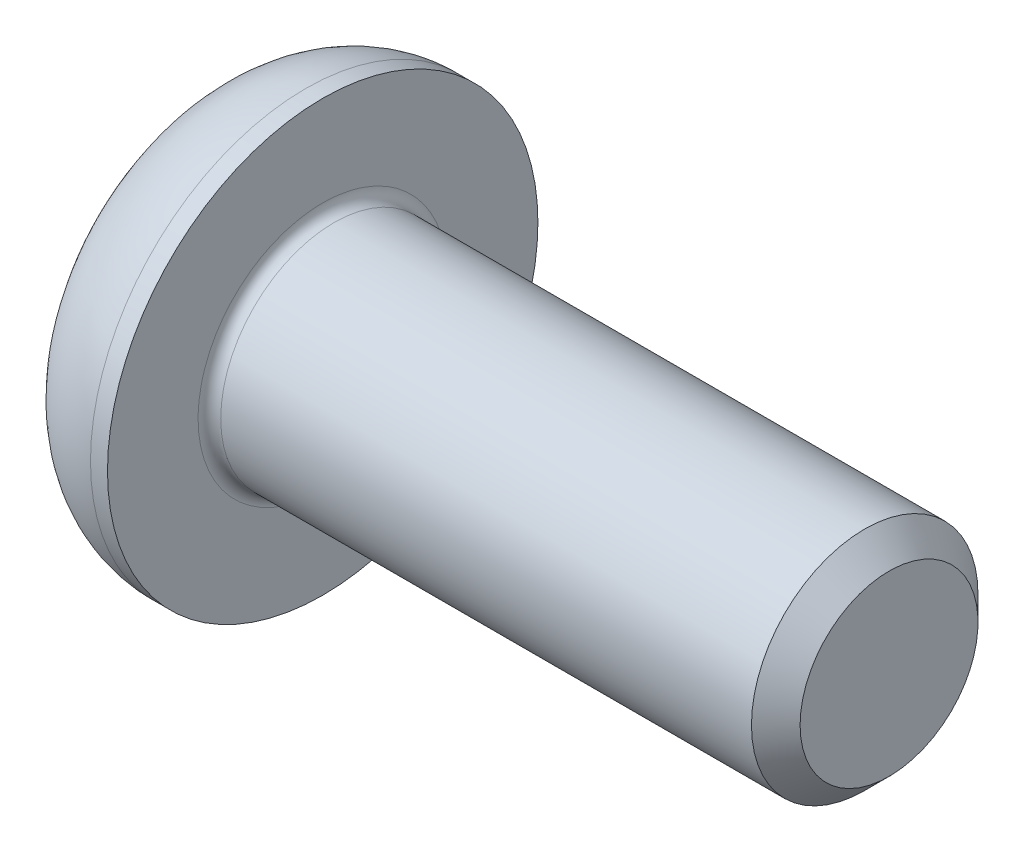
ISO-10303-21;
HEADER;
FILE_DESCRIPTION(('STEP AP214'),'2;1');
FILE_NAME('part.step','',(''),(''),'','','');
FILE_SCHEMA(('AUTOMOTIVE_DESIGN { 1 0 10303 214 1 1 1 1 }'));
ENDSEC;
DATA;
#1=APPLICATION_CONTEXT('core data for automotive mechanical design processes');
#2=APPLICATION_PROTOCOL_DEFINITION('international standard','automotive_design',2000,#1);
#3=PRODUCT_CONTEXT('',#1,'mechanical');
#4=PRODUCT('Part','Part','',(#3));
#5=PRODUCT_RELATED_PRODUCT_CATEGORY('part','',(#4));
#6=PRODUCT_DEFINITION_FORMATION('','',#4);
#7=PRODUCT_DEFINITION_CONTEXT('part definition',#1,'design');
#8=PRODUCT_DEFINITION('design','',#6,#7);
#9=PRODUCT_DEFINITION_SHAPE('','',#8);
#10=(LENGTH_UNIT() NAMED_UNIT(*) SI_UNIT(.MILLI.,.METRE.));
#11=(NAMED_UNIT(*) PLANE_ANGLE_UNIT() SI_UNIT($,.RADIAN.));
#12=(NAMED_UNIT(*) SI_UNIT($,.STERADIAN.) SOLID_ANGLE_UNIT());
#13=UNCERTAINTY_MEASURE_WITH_UNIT(LENGTH_MEASURE(1.E-05),#10,'distance_accuracy_value','');
#14=(GEOMETRIC_REPRESENTATION_CONTEXT(3) GLOBAL_UNCERTAINTY_ASSIGNED_CONTEXT((#13)) GLOBAL_UNIT_ASSIGNED_CONTEXT((#10,
#11,#12)) REPRESENTATION_CONTEXT('',''));
#15=CARTESIAN_POINT('',(0.,0.,0.));
#16=DIRECTION('',(0.,0.,1.));
#17=DIRECTION('',(1.,0.,0.));
#18=AXIS2_PLACEMENT_3D('',#15,#16,#17);
#19=CARTESIAN_POINT('',(-0.904999999875145,0.,0.));
#20=DIRECTION('',(-1.,0.,0.));
#21=DIRECTION('',(0.,0.,1.));
#22=AXIS2_PLACEMENT_3D('',#19,#20,#21);
#23=CONICAL_SURFACE('',#22,1.45203592671805,1.04719755115765);
#24=CARTESIAN_POINT('',(-0.0666666666973015,-5.6843418860808E-11,0.));
#25=VERTEX_POINT('',#24);
#26=VERTEX_LOOP('',#25);
#27=FACE_BOUND('',#26,.T.);
#28=CARTESIAN_POINT('',(-0.899999999895465,1.24999999991282,-0.721687836705776));
#29=CARTESIAN_POINT('',(-0.881684715662103,1.19507007013616,-0.753401646340966));
#30=CARTESIAN_POINT('',(-0.865027923174486,1.1396659860227,-0.785389209173815));
#31=CARTESIAN_POINT('',(-0.835953992139613,1.02789853317084,-0.84991817813204));
#32=CARTESIAN_POINT('',(-0.823547137724434,0.971533179187624,-0.882460730439183));
#33=CARTESIAN_POINT('',(-0.804234974358824,0.859500978788186,-0.947142551506237));
#34=CARTESIAN_POINT('',(-0.797201117271249,0.803851365133497,-0.979271870927009));
#35=CARTESIAN_POINT('',(-0.78880573011305,0.692290424620332,-1.04368160996113));
#36=CARTESIAN_POINT('',(-0.787437246268047,0.636379502977309,-1.07596179562322));
#37=CARTESIAN_POINT('',(-0.790291431384831,0.531915943877927,-1.13627385959031));
#38=CARTESIAN_POINT('',(-0.793813303298533,0.483347630813507,-1.16431478821198));
#39=CARTESIAN_POINT('',(-0.804973312984706,0.386527411401505,-1.22021396795239));
#40=CARTESIAN_POINT('',(-0.812615259263485,0.338275839679263,-1.24807202587511));
#41=CARTESIAN_POINT('',(-0.831718645861244,0.241256161485361,-1.30408636319712));
#42=CARTESIAN_POINT('',(-0.843261026405586,0.192500327968863,-1.33223555680244));
#43=CARTESIAN_POINT('',(-0.869457350530444,0.0957156438709913,-1.38811422021978));
#44=CARTESIAN_POINT('',(-0.884105142968317,0.0476855543224275,-1.41584440534985));
#45=CARTESIAN_POINT('',(-0.899999999989879,1.63995568404391E-10,-1.44337567287971));
#46=B_SPLINE_CURVE_WITH_KNOTS('',3,(#28,#29,#30,#31,#32,#33,#34,#35,#36,#37,#38,#39,#40,#41,#42,
#43,#44,#45),.UNSPECIFIED.,.F.,.F.,(4,2,2,2,2,2,2,2,4),(0.,0.198135007186097,0.396746135570628,
0.59044225374554,0.783900555431306,0.952317363947969,1.12089012085788,1.2932010137193,
1.4651737330377),.UNSPECIFIED.);
#47=CARTESIAN_POINT('',(-0.899999999950276,1.24999999980888,-0.721687836492175));
#48=VERTEX_POINT('',#47);
#49=CARTESIAN_POINT('',(-0.899999999982609,1.96257349450005E-12,-1.44337567286712));
#50=VERTEX_POINT('',#49);
#51=EDGE_CURVE('E103',#48,#50,#46,.T.);
#52=ORIENTED_EDGE('',*,*,#51,.T.);
#53=CARTESIAN_POINT('',(-0.899999999893595,-2.31072216434728E-10,-1.44337567300549));
#54=CARTESIAN_POINT('',(-0.881684715660365,-0.0549299299140426,-1.41166186320821));
#55=CARTESIAN_POINT('',(-0.86502792317278,-0.110334013989012,-1.3796743003089));
#56=CARTESIAN_POINT('',(-0.835953992137871,-0.222101466812513,-1.31514533130202));
#57=CARTESIAN_POINT('',(-0.823547137722625,-0.278466820805983,-1.28260277901289));
#58=CARTESIAN_POINT('',(-0.804234974356904,-0.390499021212521,-1.21792095795876));
#59=CARTESIAN_POINT('',(-0.797201117269277,-0.446148634864375,-1.18579163853346));
#60=CARTESIAN_POINT('',(-0.788805730110948,-0.557709575375265,-1.12138189949618));
#61=CARTESIAN_POINT('',(-0.787437246265866,-0.613620497018845,-1.08910171383544));
#62=CARTESIAN_POINT('',(-0.790291431382727,-0.718084056126904,-1.02878964986439));
#63=CARTESIAN_POINT('',(-0.793813303297357,-0.766652369199541,-1.00074872123762));
#64=CARTESIAN_POINT('',(-0.804973312986761,-0.863472588628037,-0.944849541487422));
#65=CARTESIAN_POINT('',(-0.812615259267848,-0.911724160358555,-0.916991483560018));
#66=CARTESIAN_POINT('',(-0.831718645871401,-1.00874383856915,-0.860977146228447));
#67=CARTESIAN_POINT('',(-0.843261026419272,-1.05749967209406,-0.832827952618252));
#68=CARTESIAN_POINT('',(-0.869457350551973,-1.15428435620845,-0.776949289191332));
#69=CARTESIAN_POINT('',(-0.884105142994157,-1.20231444576512,-0.749219104056564));
#70=CARTESIAN_POINT('',(-0.90000000002026,-1.24999999993156,-0.721687836522116));
#71=B_SPLINE_CURVE_WITH_KNOTS('',3,(#53,#54,#55,#56,#57,#58,#59,#60,#61,#62,#63,#64,#65,#66,#67,
#68,#69,#70),.UNSPECIFIED.,.F.,.F.,(4,2,2,2,2,2,2,2,4),(0.,0.198135007185751,0.396746135569964,
0.590442253744319,0.783900555429511,0.952317363975204,1.12089012091425,1.29320101380634,
1.46517373315517),.UNSPECIFIED.);
#72=CARTESIAN_POINT('',(-0.899999999987108,-1.24999999995633,-0.721687836364369));
#73=VERTEX_POINT('',#72);
#74=EDGE_CURVE('E134',#50,#73,#71,.T.);
#75=ORIENTED_EDGE('',*,*,#74,.T.);
#76=CARTESIAN_POINT('',(-0.899999999842174,-1.25000000019539,-0.721687836229797));
#77=CARTESIAN_POINT('',(-0.882896111075563,-1.24999999481034,-0.662444421267075));
#78=CARTESIAN_POINT('',(-0.867237014060793,-1.24999999738598,-0.602732338419685));
#79=CARTESIAN_POINT('',(-0.839561502195528,-1.25000000261982,-0.482338189350465));
#80=CARTESIAN_POINT('',(-0.827553237744171,-1.25000000527818,-0.421654266620353));
#81=CARTESIAN_POINT('',(-0.80824250364639,-1.24999999484458,-0.300967350520173));
#82=CARTESIAN_POINT('',(-0.800837076879798,-1.24999998211752,-0.240981348930731));
#83=CARTESIAN_POINT('',(-0.790895700381869,-1.25000001786304,-0.12066326676355));
#84=CARTESIAN_POINT('',(-0.788354464927657,-1.25000006626909,-0.0603316333839473));
#85=CARTESIAN_POINT('',(-0.788354464927002,-1.25000006626979,0.0603316333939961));
#86=CARTESIAN_POINT('',(-0.790895700382119,-1.25000001786444,0.120663266792337));
#87=CARTESIAN_POINT('',(-0.800837076887306,-1.24999998211612,0.240981348995787));
#88=CARTESIAN_POINT('',(-0.808242503660248,-1.24999999483968,0.30096735060276));
#89=CARTESIAN_POINT('',(-0.827553237762847,-1.25000000528321,0.421654266741162));
#90=CARTESIAN_POINT('',(-0.839561502212521,-1.25000000263868,0.48233818949201));
#91=CARTESIAN_POINT('',(-0.867237014115977,-1.24999999736716,0.602732338592252));
#92=CARTESIAN_POINT('',(-0.882896111170561,-1.24999999474013,0.662444421449945));
#93=CARTESIAN_POINT('',(-0.900000000022398,-1.25,0.72168783641098));
#94=B_SPLINE_CURVE_WITH_KNOTS('',3,(#76,#77,#78,#79,#80,#81,#82,#83,#84,#85,#86,#87,#88,#89,#90,
#91,#92,#93),.UNSPECIFIED.,.F.,.F.,(4,2,2,2,2,2,2,2,4),(0.,0.185045871632975,0.3705018706702,
0.551644291266182,0.732589759614195,0.913535228017753,1.09467764866905,1.28013364776468,
1.46517951945754),.UNSPECIFIED.);
#95=CARTESIAN_POINT('',(-0.899999999988181,-1.24999999987475,0.721687836509393));
#96=VERTEX_POINT('',#95);
#97=EDGE_CURVE('E274',#73,#96,#94,.T.);
#98=ORIENTED_EDGE('',*,*,#97,.T.);
#99=CARTESIAN_POINT('',(-0.899999999842517,-1.24999999987697,0.72168783678411));
#100=CARTESIAN_POINT('',(-0.881684715631303,-1.19507007008352,0.753401646392062));
#101=CARTESIAN_POINT('',(-0.865027923154306,-1.13966598596531,0.785389209212495));
#102=CARTESIAN_POINT('',(-0.835953992130203,-1.02789853311445,0.849918178159034));
#103=CARTESIAN_POINT('',(-0.823547137715168,-0.971533179136998,0.88246073046694));
#104=CARTESIAN_POINT('',(-0.804234974352029,-0.859500978745731,0.947142551532184));
#105=CARTESIAN_POINT('',(-0.797201117266771,-0.803851365093511,0.979271870950477));
#106=CARTESIAN_POINT('',(-0.78880573011195,-0.692290424586258,1.04368160998042));
#107=CARTESIAN_POINT('',(-0.787437246267998,-0.636379502946676,1.07596179564081));
#108=CARTESIAN_POINT('',(-0.79029143138629,-0.531915943852794,1.1362738596049));
#109=CARTESIAN_POINT('',(-0.793813303300584,-0.483347630790453,1.16431478822531));
#110=CARTESIAN_POINT('',(-0.804973312987493,-0.386527411382594,1.22021396796329));
#111=CARTESIAN_POINT('',(-0.812615259266423,-0.338275839662417,1.24807202588483));
#112=CARTESIAN_POINT('',(-0.831718645864065,-0.241256161473001,1.30408636320426));
#113=CARTESIAN_POINT('',(-0.843261026408104,-0.192500327958919,1.33223555680818));
#114=CARTESIAN_POINT('',(-0.869457350531995,-0.0957156438659012,1.38811422022272));
#115=CARTESIAN_POINT('',(-0.8841051429692,-0.0476855543197738,1.41584440535138));
#116=CARTESIAN_POINT('',(-0.899999999989963,-1.63745370551762E-10,1.44337567287986));
#117=B_SPLINE_CURVE_WITH_KNOTS('',3,(#99,#100,#101,#102,#103,#104,#105,#106,#107,#108,#109,#110,
#111,#112,#113,#114,#115,#116),.UNSPECIFIED.,.F.,.F.,(4,2,2,2,2,2,2,2,4),(0.,0.198135007172041,
0.396746135543351,0.590442253707212,0.783900555381576,0.952317363891064,1.120890120794,
1.29320101364705,1.4651737329568),.UNSPECIFIED.);
#118=CARTESIAN_POINT('',(-0.899999999982609,-1.69922557176371E-12,1.44337567286712));
#119=VERTEX_POINT('',#118);
#120=EDGE_CURVE('E269',#96,#119,#117,.T.);
#121=ORIENTED_EDGE('',*,*,#120,.T.);
#122=CARTESIAN_POINT('',(-0.899999999893449,2.31368760611758E-10,1.44337567300543));
#123=CARTESIAN_POINT('',(-0.881684715660276,0.0549299299142771,1.41166186320811));
#124=CARTESIAN_POINT('',(-0.865027923172723,0.110334013989197,1.3796743003088));
#125=CARTESIAN_POINT('',(-0.835953992137855,0.222101466812606,1.31514533130196));
#126=CARTESIAN_POINT('',(-0.823547137722618,0.278466820806033,1.28260277901286));
#127=CARTESIAN_POINT('',(-0.804234974356898,0.390499021212549,1.21792095795875));
#128=CARTESIAN_POINT('',(-0.79720111726927,0.446148634864426,1.18579163853343));
#129=CARTESIAN_POINT('',(-0.788805730110944,0.557709575375368,1.12138189949612));
#130=CARTESIAN_POINT('',(-0.787437246265865,0.613620497018976,1.08910171383536));
#131=CARTESIAN_POINT('',(-0.790291431382515,0.718084056119022,1.02878964986894));
#132=CARTESIAN_POINT('',(-0.793813303296201,0.766652369183635,1.00074872124681));
#133=CARTESIAN_POINT('',(-0.804973312982414,0.863472588596216,0.944849541505793));
#134=CARTESIAN_POINT('',(-0.81261525926125,0.911724160318843,0.916991483582945));
#135=CARTESIAN_POINT('',(-0.831718645859188,1.00874383851348,0.860977146260592));
#136=CARTESIAN_POINT('',(-0.843261026403653,1.05749967203032,0.832827952655053));
#137=CARTESIAN_POINT('',(-0.869457350528802,1.15428435612887,0.776949289237277));
#138=CARTESIAN_POINT('',(-0.884105142966843,1.20231444567776,0.749219104106998));
#139=CARTESIAN_POINT('',(-0.899999999988587,1.24999999983654,0.721687836576975));
#140=B_SPLINE_CURVE_WITH_KNOTS('',3,(#122,#123,#124,#125,#126,#127,#128,#129,#130,#131,#132,
#133,#134,#135,#136,#137,#138,#139),.UNSPECIFIED.,.F.,.F.,(4,2,2,2,2,2,2,2,4),(0.,
0.198135007185603,0.396746135569654,0.590442253744091,0.783900555429375,0.952317363947233,
1.12089012085834,1.29320101372104,1.4651737330407),.UNSPECIFIED.);
#141=CARTESIAN_POINT('',(-0.899999999982482,1.24999999990819,0.721687836431727));
#142=VERTEX_POINT('',#141);
#143=EDGE_CURVE('E106',#119,#142,#140,.T.);
#144=ORIENTED_EDGE('',*,*,#143,.T.);
#145=CARTESIAN_POINT('',(-0.899999999895439,1.25000000014505,0.721687836300142));
#146=CARTESIAN_POINT('',(-0.882896111105858,1.24999999479226,0.662444421335814));
#147=CARTESIAN_POINT('',(-0.867237014079879,1.24999999738113,0.6027323384837));
#148=CARTESIAN_POINT('',(-0.83956150220309,1.25000000262467,0.482338189402405));
#149=CARTESIAN_POINT('',(-0.827553237751427,1.25000000527947,0.42165426666494));
#150=CARTESIAN_POINT('',(-0.808242503651249,1.24999999484333,0.300967350551273));
#151=CARTESIAN_POINT('',(-0.800837076882572,1.24999998211718,0.240981348955692));
#152=CARTESIAN_POINT('',(-0.790895700382171,1.25000001786337,0.120663266775804));
#153=CARTESIAN_POINT('',(-0.788354464927581,1.25000006626918,0.0603316333896348));
#154=CARTESIAN_POINT('',(-0.788354464927077,1.2500000662697,-0.0603316333854344));
#155=CARTESIAN_POINT('',(-0.79089570038138,1.25000001786441,-0.120663266774334));
#156=CARTESIAN_POINT('',(-0.800837076883513,1.24999998211614,-0.240981348958975));
#157=CARTESIAN_POINT('',(-0.808242503654205,1.24999999483968,-0.300967350556579));
#158=CARTESIAN_POINT('',(-0.82755323775111,1.2500000052832,-0.421654266676448));
#159=CARTESIAN_POINT('',(-0.839561502197323,1.25000000263867,-0.482338189418136));
#160=CARTESIAN_POINT('',(-0.867237014093116,1.24999999736716,-0.602732338500565));
#161=CARTESIAN_POINT('',(-0.882896111143514,1.24999999474014,-0.662444421349601));
#162=CARTESIAN_POINT('',(-0.89999999999097,1.25,-0.721687836302114));
#163=B_SPLINE_CURVE_WITH_KNOTS('',3,(#145,#146,#147,#148,#149,#150,#151,#152,#153,#154,#155,
#156,#157,#158,#159,#160,#161,#162),.UNSPECIFIED.,.F.,.F.,(4,2,2,2,2,2,2,2,4),(0.,
0.185045871655127,0.370501870713738,0.551644291328948,0.732589759696517,0.913535228071817,
1.09467764869446,1.28013364776116,1.46517951942576),.UNSPECIFIED.);
#164=EDGE_CURVE('E99',#142,#48,#163,.T.);
#165=ORIENTED_EDGE('',*,*,#164,.T.);
#166=EDGE_LOOP('',(#52,#75,#98,#121,#144,#165));
#167=FACE_BOUND('',#166,.T.);
#168=ADVANCED_FACE('F17',(#27,#167),#23,.F.);
#169=CARTESIAN_POINT('',(-2.2,1.25,0.721687836487));
#170=DIRECTION('',(0.,1.,0.));
#171=DIRECTION('',(0.,0.,1.));
#172=AXIS2_PLACEMENT_3D('',#169,#170,#171);
#173=PLANE('',#172);
#174=ORIENTED_EDGE('',*,*,#164,.F.);
#175=DIRECTION('',(1.,0.,0.));
#176=VECTOR('',#175,1.);
#177=CARTESIAN_POINT('',(-2.2,1.2499999999981,0.721687836483702));
#178=LINE('',#177,#176);
#179=CARTESIAN_POINT('',(-2.2,1.24999999978205,0.721687836484204));
#180=VERTEX_POINT('',#179);
#181=EDGE_CURVE('E109',#142,#180,#178,.F.);
#182=ORIENTED_EDGE('',*,*,#181,.T.);
#183=DIRECTION('',(0.,0.,1.));
#184=VECTOR('',#183,1.);
#185=CARTESIAN_POINT('',(-2.2,1.24999999954,0.));
#186=LINE('',#185,#184);
#187=CARTESIAN_POINT('',(-2.2,1.24999999961776,-0.721687836707686));
#188=VERTEX_POINT('',#187);
#189=EDGE_CURVE('E115',#188,#180,#186,.T.);
#190=ORIENTED_EDGE('',*,*,#189,.F.);
#191=DIRECTION('',(1.,0.,0.));
#192=VECTOR('',#191,1.);
#193=CARTESIAN_POINT('',(-2.2,1.24999999961776,-0.721687836707686));
#194=LINE('',#193,#192);
#195=EDGE_CURVE('E112',#188,#48,#194,.T.);
#196=ORIENTED_EDGE('',*,*,#195,.T.);
#197=EDGE_LOOP('',(#174,#182,#190,#196));
#198=FACE_BOUND('',#197,.T.);
#199=ADVANCED_FACE('F113',(#198),#173,.F.);
#200=CARTESIAN_POINT('',(-2.2,0.,1.44337567297));
#201=DIRECTION('',(0.,0.50000000000019,0.866025403784329));
#202=DIRECTION('',(0.,-0.866025403784329,0.50000000000019));
#203=AXIS2_PLACEMENT_3D('',#200,#201,#202);
#204=PLANE('',#203);
#205=DIRECTION('',(1.,0.,0.));
#206=VECTOR('',#205,1.);
#207=CARTESIAN_POINT('',(-2.2,-1.90407585531904E-12,1.4433756729733));
#208=LINE('',#207,#206);
#209=CARTESIAN_POINT('',(-2.2,-1.83056521900652E-10,1.44337567308873));
#210=VERTEX_POINT('',#209);
#211=EDGE_CURVE('E267',#119,#210,#208,.F.);
#212=ORIENTED_EDGE('',*,*,#211,.T.);
#213=DIRECTION('',(0.,-0.866025403757106,0.500000000047341));
#214=VECTOR('',#213,1.);
#215=CARTESIAN_POINT('',(-2.2,1.24999999954,0.721687836573));
#216=LINE('',#215,#214);
#217=EDGE_CURVE('E123',#180,#210,#216,.T.);
#218=ORIENTED_EDGE('',*,*,#217,.F.);
#219=ORIENTED_EDGE('',*,*,#181,.F.);
#220=ORIENTED_EDGE('',*,*,#143,.F.);
#221=EDGE_LOOP('',(#212,#218,#219,#220));
#222=FACE_BOUND('',#221,.T.);
#223=ADVANCED_FACE('F397',(#222),#204,.F.);
#224=CARTESIAN_POINT('',(-2.2,-1.25,0.721687836487));
#225=DIRECTION('',(0.,-0.50000000000019,0.866025403784329));
#226=DIRECTION('',(0.,-0.866025403784329,-0.50000000000019));
#227=AXIS2_PLACEMENT_3D('',#224,#225,#226);
#228=PLANE('',#227);
#229=DIRECTION('',(1.,0.,0.));
#230=VECTOR('',#229,1.);
#231=CARTESIAN_POINT('',(-2.2,-1.25,0.721687836658));
#232=LINE('',#231,#230);
#233=CARTESIAN_POINT('',(-2.2,-1.25000000023,0.721687836560204));
#234=VERTEX_POINT('',#233);
#235=EDGE_CURVE('E272',#96,#234,#232,.F.);
#236=ORIENTED_EDGE('',*,*,#235,.T.);
#237=DIRECTION('',(0.,-0.86602540375779,-0.500000000046157));
#238=VECTOR('',#237,1.);
#239=CARTESIAN_POINT('',(-2.2,-4.58026845617798E-10,1.44337567315));
#240=LINE('',#239,#238);
#241=EDGE_CURVE('E240',#210,#234,#240,.T.);
#242=ORIENTED_EDGE('',*,*,#241,.F.);
#243=ORIENTED_EDGE('',*,*,#211,.F.);
#244=ORIENTED_EDGE('',*,*,#120,.F.);
#245=EDGE_LOOP('',(#236,#242,#243,#244));
#246=FACE_BOUND('',#245,.T.);
#247=ADVANCED_FACE('F389',(#246),#228,.F.);
#248=CARTESIAN_POINT('',(-2.2,-1.25,-0.721687836487));
#249=DIRECTION('',(0.,-1.,0.));
#250=DIRECTION('',(1.,0.,0.));
#251=AXIS2_PLACEMENT_3D('',#248,#249,#250);
#252=PLANE('',#251);
#253=ORIENTED_EDGE('',*,*,#97,.F.);
#254=DIRECTION('',(1.,0.,0.));
#255=VECTOR('',#254,1.);
#256=CARTESIAN_POINT('',(-2.2,-1.2500000001474,-0.7216878363975));
#257=LINE('',#256,#255);
#258=CARTESIAN_POINT('',(-2.2,-1.25000000019764,-0.721687836546482));
#259=VERTEX_POINT('',#258);
#260=EDGE_CURVE('E277',#73,#259,#257,.F.);
#261=ORIENTED_EDGE('',*,*,#260,.T.);
#262=DIRECTION('',(0.,0.,1.));
#263=VECTOR('',#262,1.);
#264=CARTESIAN_POINT('',(-2.2,-1.25000000046,0.));
#265=LINE('',#264,#263);
#266=EDGE_CURVE('E245',#234,#259,#265,.F.);
#267=ORIENTED_EDGE('',*,*,#266,.F.);
#268=ORIENTED_EDGE('',*,*,#235,.F.);
#269=EDGE_LOOP('',(#253,#261,#267,#268));
#270=FACE_BOUND('',#269,.T.);
#271=ADVANCED_FACE('F382',(#270),#252,.F.);
#272=CARTESIAN_POINT('',(-2.2,0.,-1.44337567297));
#273=DIRECTION('',(0.,-0.50000000000019,-0.866025403784329));
#274=DIRECTION('',(0.,0.866025403784329,-0.50000000000019));
#275=AXIS2_PLACEMENT_3D('',#272,#273,#274);
#276=PLANE('',#275);
#277=DIRECTION('',(1.,0.,0.));
#278=VECTOR('',#277,1.);
#279=CARTESIAN_POINT('',(-2.2,1.90385901488455E-12,-1.4433756729733));
#280=LINE('',#279,#278);
#281=CARTESIAN_POINT('',(-2.2,-1.03210381673068E-10,-1.44337567298957));
#282=VERTEX_POINT('',#281);
#283=EDGE_CURVE('E119',#50,#282,#280,.F.);
#284=ORIENTED_EDGE('',*,*,#283,.T.);
#285=DIRECTION('',(0.,0.86602540375779,-0.500000000046157));
#286=VECTOR('',#285,1.);
#287=CARTESIAN_POINT('',(-2.2,-1.25000000046,-0.721687836573));
#288=LINE('',#287,#286);
#289=EDGE_CURVE('E250',#259,#282,#288,.T.);
#290=ORIENTED_EDGE('',*,*,#289,.F.);
#291=ORIENTED_EDGE('',*,*,#260,.F.);
#292=ORIENTED_EDGE('',*,*,#74,.F.);
#293=EDGE_LOOP('',(#284,#290,#291,#292));
#294=FACE_BOUND('',#293,.T.);
#295=ADVANCED_FACE('F376',(#294),#276,.F.);
#296=CARTESIAN_POINT('',(-2.2,1.25,-0.721687836487));
#297=DIRECTION('',(0.,0.50000000000019,-0.866025403784329));
#298=DIRECTION('',(0.,0.866025403784329,0.50000000000019));
#299=AXIS2_PLACEMENT_3D('',#296,#297,#298);
#300=PLANE('',#299);
#301=ORIENTED_EDGE('',*,*,#195,.F.);
#302=DIRECTION('',(0.,0.866025403757106,0.500000000047341));
#303=VECTOR('',#302,1.);
#304=CARTESIAN_POINT('',(-2.2,-4.58026845617798E-10,-1.44337567315));
#305=LINE('',#304,#303);
#306=EDGE_CURVE('E255',#282,#188,#305,.T.);
#307=ORIENTED_EDGE('',*,*,#306,.F.);
#308=ORIENTED_EDGE('',*,*,#283,.F.);
#309=ORIENTED_EDGE('',*,*,#51,.F.);
#310=EDGE_LOOP('',(#301,#307,#308,#309));
#311=FACE_BOUND('',#310,.T.);
#312=ADVANCED_FACE('F121',(#311),#300,.F.);
#313=CARTESIAN_POINT('',(-2.2,2.62168783649,0.));
#314=DIRECTION('',(-1.,0.,0.));
#315=DIRECTION('',(0.,-1.,0.));
#316=AXIS2_PLACEMENT_3D('',#313,#314,#315);
#317=PLANE('',#316);
#318=ORIENTED_EDGE('',*,*,#289,.T.);
#319=ORIENTED_EDGE('',*,*,#306,.T.);
#320=ORIENTED_EDGE('',*,*,#189,.T.);
#321=ORIENTED_EDGE('',*,*,#217,.T.);
#322=ORIENTED_EDGE('',*,*,#241,.T.);
#323=ORIENTED_EDGE('',*,*,#266,.T.);
#324=EDGE_LOOP('',(#318,#319,#320,#321,#322,#323));
#325=FACE_BOUND('',#324,.T.);
#326=CARTESIAN_POINT('',(-2.2,0.,-1.9));
#327=CARTESIAN_POINT('',(-2.2,-0.36265690061289,-1.89979752619059));
#328=CARTESIAN_POINT('',(-2.2,-0.699379948167787,-1.76659777201864));
#329=CARTESIAN_POINT('',(-2.2,-1.06480278954368,-1.62204505133757));
#330=CARTESIAN_POINT('',(-2.2,-1.34350288425459,-1.34350288425459));
#331=CARTESIAN_POINT('',(-2.2,-1.6214575775046,-1.06570569624483));
#332=CARTESIAN_POINT('',(-2.2,-1.76659777201864,-0.699379948167787));
#333=CARTESIAN_POINT('',(-2.2,-1.89979722746393,-0.363191958873555));
#334=CARTESIAN_POINT('',(-2.2,-1.9,0.));
#335=B_SPLINE_CURVE_WITH_KNOTS('',2,(#326,#327,#328,#329,#330,#331,#332,#333,#334),
.UNSPECIFIED.,.F.,.F.,(3,2,2,2,3),(0.,0.25,0.5,0.75,1.),.UNSPECIFIED.);
#336=CARTESIAN_POINT('',(-2.2,0.,-1.9));
#337=VERTEX_POINT('',#336);
#338=CARTESIAN_POINT('',(-2.2,-1.9,0.));
#339=VERTEX_POINT('',#338);
#340=EDGE_CURVE('E287',#337,#339,#335,.T.);
#341=ORIENTED_EDGE('',*,*,#340,.T.);
#342=CARTESIAN_POINT('',(-2.2,-1.9,0.));
#343=CARTESIAN_POINT('',(-2.2,-1.89979752619059,0.362656900612583));
#344=CARTESIAN_POINT('',(-2.2,-1.76659777201864,0.699379948167787));
#345=CARTESIAN_POINT('',(-2.2,-1.62204505133753,1.06480278954412));
#346=CARTESIAN_POINT('',(-2.2,-1.34350288425459,1.34350288425459));
#347=CARTESIAN_POINT('',(-2.2,-1.06570569624445,1.62145757750459));
#348=CARTESIAN_POINT('',(-2.2,-0.699379948167787,1.76659777201864));
#349=CARTESIAN_POINT('',(-2.2,-0.36319195887394,1.89979722746393));
#350=CARTESIAN_POINT('',(-2.2,0.,1.9));
#351=B_SPLINE_CURVE_WITH_KNOTS('',2,(#342,#343,#344,#345,#346,#347,#348,#349,#350),
.UNSPECIFIED.,.F.,.F.,(3,2,2,2,3),(0.,0.25,0.5,0.75,1.),.UNSPECIFIED.);
#352=CARTESIAN_POINT('',(-2.2,0.,1.9));
#353=VERTEX_POINT('',#352);
#354=EDGE_CURVE('E284',#339,#353,#351,.T.);
#355=ORIENTED_EDGE('',*,*,#354,.T.);
#356=CARTESIAN_POINT('',(-2.2,0.,1.9));
#357=CARTESIAN_POINT('',(-2.2,0.362656900612794,1.89979752619059));
#358=CARTESIAN_POINT('',(-2.2,0.699379948167786,1.76659777201864));
#359=CARTESIAN_POINT('',(-2.2,1.06480278954374,1.62204505133758));
#360=CARTESIAN_POINT('',(-2.2,1.34350288425459,1.34350288425459));
#361=CARTESIAN_POINT('',(-2.2,1.62145757750463,1.06570569624472));
#362=CARTESIAN_POINT('',(-2.2,1.76659777201864,0.699379948167782));
#363=CARTESIAN_POINT('',(-2.2,1.89979722746393,0.363191958873572));
#364=CARTESIAN_POINT('',(-2.2,1.9,0.));
#365=B_SPLINE_CURVE_WITH_KNOTS('',2,(#356,#357,#358,#359,#360,#361,#362,#363,#364),
.UNSPECIFIED.,.F.,.F.,(3,2,2,2,3),(0.,0.25,0.5,0.75,1.),.UNSPECIFIED.);
#366=CARTESIAN_POINT('',(-2.2,1.9,0.));
#367=VERTEX_POINT('',#366);
#368=EDGE_CURVE('E259',#353,#367,#365,.T.);
#369=ORIENTED_EDGE('',*,*,#368,.T.);
#370=CARTESIAN_POINT('',(-2.2,1.9,0.));
#371=CARTESIAN_POINT('',(-2.2,1.89979752619059,-0.36265690061314));
#372=CARTESIAN_POINT('',(-2.2,1.76659777201864,-0.699379948167792));
#373=CARTESIAN_POINT('',(-2.2,1.62204505133735,-1.06480278954399));
#374=CARTESIAN_POINT('',(-2.2,1.34350288425459,-1.34350288425459));
#375=CARTESIAN_POINT('',(-2.2,1.06570569624542,-1.62145757750393));
#376=CARTESIAN_POINT('',(-2.2,0.699379948167788,-1.76659777201864));
#377=CARTESIAN_POINT('',(-2.2,0.363191958874567,-1.89979722746393));
#378=CARTESIAN_POINT('',(-2.2,0.,-1.9));
#379=B_SPLINE_CURVE_WITH_KNOTS('',2,(#370,#371,#372,#373,#374,#375,#376,#377,#378),
.UNSPECIFIED.,.F.,.F.,(3,2,2,2,3),(0.,0.25,0.5,0.75,1.),.UNSPECIFIED.);
#380=EDGE_CURVE('E305',#367,#337,#379,.T.);
#381=ORIENTED_EDGE('',*,*,#380,.T.);
#382=EDGE_LOOP('',(#341,#355,#369,#381));
#383=FACE_BOUND('',#382,.T.);
#384=ADVANCED_FACE('F290',(#325,#383),#317,.T.);
#385=CARTESIAN_POINT('',(-0.3,0.,0.));
#386=DIRECTION('',(1.,0.,0.));
#387=DIRECTION('',(0.,0.,-1.));
#388=AXIS2_PLACEMENT_3D('',#385,#386,#387);
#389=DEGENERATE_TOROIDAL_SURFACE('',#388,1.9,1.90000000000007,.T.);
#390=CARTESIAN_POINT('',(-0.3,0.,0.));
#391=DIRECTION('',(1.,0.,0.));
#392=DIRECTION('',(0.,0.,-1.));
#393=AXIS2_PLACEMENT_3D('',#390,#391,#392);
#394=CIRCLE('',#393,3.8);
#395=CARTESIAN_POINT('',(-0.3,0.,-3.8));
#396=VERTEX_POINT('',#395);
#397=EDGE_CURVE('E308',#396,#396,#394,.T.);
#398=ORIENTED_EDGE('',*,*,#397,.F.);
#399=EDGE_LOOP('',(#398));
#400=FACE_BOUND('',#399,.T.);
#401=ORIENTED_EDGE('',*,*,#380,.F.);
#402=ORIENTED_EDGE('',*,*,#368,.F.);
#403=ORIENTED_EDGE('',*,*,#354,.F.);
#404=ORIENTED_EDGE('',*,*,#340,.F.);
#405=EDGE_LOOP('',(#401,#402,#403,#404));
#406=FACE_BOUND('',#405,.T.);
#407=ADVANCED_FACE('F19',(#400,#406),#389,.T.);
#408=CARTESIAN_POINT('',(-1.1,0.,0.));
#409=DIRECTION('',(1.,0.,0.));
#410=DIRECTION('',(0.,0.,-1.));
#411=AXIS2_PLACEMENT_3D('',#408,#409,#410);
#412=CYLINDRICAL_SURFACE('',#411,3.8);
#413=ORIENTED_EDGE('',*,*,#397,.T.);
#414=EDGE_LOOP('',(#413));
#415=FACE_BOUND('',#414,.T.);
#416=CARTESIAN_POINT('',(0.,0.,0.));
#417=DIRECTION('',(1.,0.,0.));
#418=DIRECTION('',(0.,0.,-1.));
#419=AXIS2_PLACEMENT_3D('',#416,#417,#418);
#420=CIRCLE('',#419,3.8);
#421=CARTESIAN_POINT('',(0.,0.,-3.8));
#422=VERTEX_POINT('',#421);
#423=EDGE_CURVE('E132',#422,#422,#420,.T.);
#424=ORIENTED_EDGE('',*,*,#423,.F.);
#425=EDGE_LOOP('',(#424));
#426=FACE_BOUND('',#425,.T.);
#427=ADVANCED_FACE('F201',(#415,#426),#412,.T.);
#428=CARTESIAN_POINT('',(0.,2.9,0.));
#429=DIRECTION('',(1.,0.,0.));
#430=DIRECTION('',(0.,1.,0.));
#431=AXIS2_PLACEMENT_3D('',#428,#429,#430);
#432=PLANE('',#431);
#433=CARTESIAN_POINT('',(0.,0.,0.));
#434=DIRECTION('',(1.,0.,0.));
#435=DIRECTION('',(0.,0.,1.));
#436=AXIS2_PLACEMENT_3D('',#433,#434,#435);
#437=CIRCLE('',#436,2.2);
#438=CARTESIAN_POINT('',(0.,-2.2,0.));
#439=VERTEX_POINT('',#438);
#440=CARTESIAN_POINT('',(0.,0.,2.2));
#441=VERTEX_POINT('',#440);
#442=EDGE_CURVE('E219',#439,#441,#437,.F.);
#443=ORIENTED_EDGE('',*,*,#442,.T.);
#444=CARTESIAN_POINT('',(0.,2.2,0.));
#445=CARTESIAN_POINT('',(2.59485219937396E-09,2.19998575154874,0.0307475517317676));
#446=CARTESIAN_POINT('',(1.81769916154887E-09,2.19933455898998,0.0614948549161519));
#447=CARTESIAN_POINT('',(-1.18157770128654E-10,2.19676157840836,0.122934729205102));
#448=CARTESIAN_POINT('',(-1.27684270670489E-09,2.19483985351,0.153627302952858));
#449=CARTESIAN_POINT('',(2.38564245291242E-09,2.18972916496953,0.214905757204253));
#450=CARTESIAN_POINT('',(7.20665803284578E-09,2.18654023407363,0.245491640444308));
#451=CARTESIAN_POINT('',(4.27781037724046E-08,2.17889884798254,0.306505997739295));
#452=CARTESIAN_POINT('',(7.35284820533063E-08,2.17444639531538,0.336934472109042));
#453=CARTESIAN_POINT('',(1.73591454632761E-07,2.16683112781648,0.38241870801543));
#454=CARTESIAN_POINT('',(2.15937663304364E-07,2.164136501512,0.397554210627282));
#455=CARTESIAN_POINT('',(3.11082697400108E-07,2.15843235202415,0.427741458892821));
#456=CARTESIAN_POINT('',(3.63865186036048E-07,2.15542332442782,0.442793298123176));
#457=CARTESIAN_POINT('',(4.98662459451756E-07,2.14590969967549,0.487844204128152));
#458=CARTESIAN_POINT('',(5.57143956355824E-07,2.13891800198918,0.51774201553623));
#459=CARTESIAN_POINT('',(5.80198729461921E-07,2.12365058896836,0.577202730744742));
#460=CARTESIAN_POINT('',(5.4478259433153E-07,2.11537501851295,0.606765671930331));
#461=CARTESIAN_POINT('',(3.95827864927652E-07,2.09757534103425,0.66550932321324));
#462=CARTESIAN_POINT('',(2.82302068258698E-07,2.0880514387464,0.694690095127757));
#463=CARTESIAN_POINT('',(9.51522408715628E-08,2.06769565514402,0.75258394329037));
#464=CARTESIAN_POINT('',(2.15196427242832E-08,2.05686405528101,0.781297118673312));
#465=CARTESIAN_POINT('',(-1.30858420855072E-08,2.03864474828845,0.827145712723559));
#466=CARTESIAN_POINT('',(-6.90180737569616E-09,2.03157101672207,0.844408395369794));
#467=CARTESIAN_POINT('',(2.18093352037547E-08,2.00213373394309,0.913762935807425));
#468=CARTESIAN_POINT('',(5.19555767048306E-08,1.97799447356219,0.965125009730387));
#469=CARTESIAN_POINT('',(2.14150389555591E-07,1.93895336641498,1.04046425938531));
#470=CARTESIAN_POINT('',(2.87289391212782E-07,1.92551544493197,1.06521630024549));
#471=CARTESIAN_POINT('',(4.36733867957351E-07,1.89560156299219,1.11785037861587));
#472=CARTESIAN_POINT('',(5.1187296773137E-07,1.87897202391597,1.1456459737916));
#473=CARTESIAN_POINT('',(5.72744867043978E-07,1.85428340649297,1.18487768253396));
#474=CARTESIAN_POINT('',(5.85020363817311E-07,1.84672549558327,1.19663240914968));
#475=CARTESIAN_POINT('',(5.9812196359109E-07,1.8299215577809,1.2222176966298));
#476=CARTESIAN_POINT('',(5.96322010245577E-07,1.82062818382307,1.23601720150462));
#477=CARTESIAN_POINT('',(5.76338004347892E-07,1.79227906739977,1.27708907650998));
#478=CARTESIAN_POINT('',(5.43573036460935E-07,1.77275210116351,1.30403837564686));
#479=CARTESIAN_POINT('',(4.44114124760274E-07,1.73248190795096,1.35700609597222));
#480=CARTESIAN_POINT('',(3.77423598121325E-07,1.71173880365716,1.38302461063215));
#481=CARTESIAN_POINT('',(2.34286813257575E-07,1.66909325013756,1.43408936194957));
#482=CARTESIAN_POINT('',(1.57841772838947E-07,1.64719094583199,1.45913571946822));
#483=CARTESIAN_POINT('',(4.54228324004362E-08,1.60222702315862,1.50815793972183));
#484=CARTESIAN_POINT('',(9.4429142166888E-09,1.57916557771687,1.53213396113274));
#485=CARTESIAN_POINT('',(-4.87653383120489E-09,1.54348315572177,1.56777134290827));
#486=CARTESIAN_POINT('',(-2.67585445377206E-09,1.53120625718695,1.57978107133869));
#487=CARTESIAN_POINT('',(8.29094956159275E-09,1.49140205664461,1.61783381516971));
#488=CARTESIAN_POINT('',(2.17747310029153E-08,1.46334418618564,1.64332792091646));
#489=CARTESIAN_POINT('',(1.02315018301225E-07,1.41120609584572,1.68830526375708));
#490=CARTESIAN_POINT('',(1.59116773354958E-07,1.38733752968222,1.7080347526656));
#491=CARTESIAN_POINT('',(2.65390069654455E-07,1.35083196897502,1.73693217161771));
#492=CARTESIAN_POINT('',(3.0451878668248E-07,1.33849729906979,1.74648404323975));
#493=CARTESIAN_POINT('',(4.25501601250817E-07,1.29880301236246,1.77654339387269));
#494=CARTESIAN_POINT('',(5.02704245090918E-07,1.27105486026134,1.79654189751559));
#495=CARTESIAN_POINT('',(5.83896797467601E-07,1.21373301910697,1.83581766762292));
#496=CARTESIAN_POINT('',(5.85454237653243E-07,1.18412932075259,1.85505110414693));
#497=CARTESIAN_POINT('',(5.34064931872144E-07,1.1301972375275,1.88824619380719));
#498=CARTESIAN_POINT('',(4.9225416229727E-07,1.10603509283751,1.90247890999467));
#499=CARTESIAN_POINT('',(4.08171291680548E-07,1.05311429333873,1.93230473215172));
#500=CARTESIAN_POINT('',(3.66982781964309E-07,1.02426048554965,1.94772945012926));
#501=CARTESIAN_POINT('',(2.82488884109061E-07,0.96589310223352,1.9772714931596));
#502=CARTESIAN_POINT('',(2.39183592141503E-07,0.936379556713241,1.99138887752411));
#503=CARTESIAN_POINT('',(1.59228282364983E-07,0.876752786328612,2.01828935942024));
#504=CARTESIAN_POINT('',(1.22577924419526E-07,0.846639592199901,2.03107252513014));
#505=CARTESIAN_POINT('',(6.07868053446082E-08,0.785871917563535,2.05527997419745));
#506=CARTESIAN_POINT('',(3.56453899029977E-08,0.755217467930543,2.06670433477897));
#507=CARTESIAN_POINT('',(1.47469855892725E-08,0.715499421687146,2.08050204492076));
#508=CARTESIAN_POINT('',(1.08283039984752E-08,0.70665357672506,2.08351172416458));
#509=CARTESIAN_POINT('',(2.97863817094369E-09,0.682932035571092,2.09141568160682));
#510=CARTESIAN_POINT('',(8.29995906575618E-10,0.668022403577947,2.0962086325941));
#511=CARTESIAN_POINT('',(-8.2175054130461E-10,0.630074243776163,2.10796762337689));
#512=CARTESIAN_POINT('',(1.71472681036998E-09,0.606968901605445,2.11471887821384));
#513=CARTESIAN_POINT('',(8.19264836757994E-09,0.558138740474107,2.12812770984968));
#514=CARTESIAN_POINT('',(1.2252700245171E-08,0.532391218259492,2.13470264940344));
#515=CARTESIAN_POINT('',(1.92876140244171E-08,0.478241709912523,2.14749648977462));
#516=CARTESIAN_POINT('',(2.21243433426206E-08,0.449818005446209,2.15362361130686));
#517=CARTESIAN_POINT('',(2.52900679093038E-08,0.390295658095807,2.16523057136501));
#518=CARTESIAN_POINT('',(2.53822987484052E-08,0.35917728008837,2.1706093598745));
#519=CARTESIAN_POINT('',(2.29929838149876E-08,0.294264624302177,2.18040073142822));
#520=CARTESIAN_POINT('',(2.03069437023492E-08,0.260453672957132,2.18470300072236));
#521=CARTESIAN_POINT('',(1.36106905301821E-08,0.190179999648033,2.19199506470414));
#522=CARTESIAN_POINT('',(9.51773790880974E-09,0.153704837206926,2.19486531058542));
#523=CARTESIAN_POINT('',(2.67171525134552E-09,0.0781580593471225,2.19892314603233));
#524=CARTESIAN_POINT('',(2.94482002358293E-11,0.0390795052034036,2.19998220685239));
#525=CARTESIAN_POINT('',(0.,0.,2.2));
#526=B_SPLINE_CURVE_WITH_KNOTS('',3,(#444,#445,#446,#447,#448,#449,#450,#451,#452,#453,#454,
#455,#456,#457,#458,#459,#460,#461,#462,#463,#464,#465,#466,#467,#468,#469,#470,#471,#472,#473,
#474,#475,#476,#477,#478,#479,#480,#481,#482,#483,#484,#485,#486,#487,#488,#489,#490,#491,#492,
#493,#494,#495,#496,#497,#498,#499,#500,#501,#502,#503,#504,#505,#506,#507,#508,#509,#510,#511,
#512,#513,#514,#515,#516,#517,#518,#519,#520,#521,#522,#523,#524,#525),.UNSPECIFIED.,.F.,.F.,(4,
2,2,2,2,2,2,2,2,2,2,2,2,2,2,2,2,2,2,2,2,2,2,2,2,2,2,2,2,2,2,2,2,2,2,2,2,2,2,2,4),(0.,
0.0922362118361924,0.184467841398753,0.276697087733335,0.368926149538729,0.415043763481237,
0.461089749172816,0.553171521661488,0.645242910695482,0.737299218205584,0.829335747937528,
0.885302080928185,1.05534678779383,1.13982630940569,1.23695847872775,1.2788810070784,
1.32878838880579,1.42859054126646,1.528382643078,1.62816229847186,1.72792711220148,
1.77944791132512,1.89312235705838,1.98599557628428,2.03279521089465,2.13536475277944,
2.24123043663748,2.32533848733158,2.42345873836252,2.52157453564678,2.61968531677868,
2.71779051937448,2.74582161925946,2.79280129254342,2.86500265504924,2.94470684302184,
3.03191400578307,3.1266244436827,3.22883860845309,3.33855710343755,3.45578068374016),.UNSPECIFIED.);
#527=CARTESIAN_POINT('',(0.,2.2,0.));
#528=VERTEX_POINT('',#527);
#529=EDGE_CURVE('E163',#441,#528,#526,.F.);
#530=ORIENTED_EDGE('',*,*,#529,.T.);
#531=CARTESIAN_POINT('',(0.,0.,-2.2));
#532=CARTESIAN_POINT('',(2.59485222266369E-09,0.0307475517317842,-2.19998575154874));
#533=CARTESIAN_POINT('',(1.81769918579815E-09,0.0614948549161851,-2.19933455898998));
#534=CARTESIAN_POINT('',(-1.18157743975029E-10,0.122934729205169,-2.19676157840836));
#535=CARTESIAN_POINT('',(-1.27684267960648E-09,0.153627302952941,-2.19483985351));
#536=CARTESIAN_POINT('',(2.38564247387581E-09,0.214905757204369,-2.18972916496953));
#537=CARTESIAN_POINT('',(7.20665804672946E-09,0.245491640444441,-2.18654023407363));
#538=CARTESIAN_POINT('',(4.27781038041582E-08,0.30650599773946,-2.17889884798254));
#539=CARTESIAN_POINT('',(7.35284821100098E-08,0.336934472109224,-2.17444639531538));
#540=CARTESIAN_POINT('',(1.73591454718074E-07,0.382418708015636,-2.16683112781648));
#541=CARTESIAN_POINT('',(2.15937663397744E-07,0.397554210627495,-2.16413650151199));
#542=CARTESIAN_POINT('',(3.11082697511153E-07,0.427741458893036,-2.15843235202415));
#543=CARTESIAN_POINT('',(3.63865186156679E-07,0.442793298123384,-2.15542332442782));
#544=CARTESIAN_POINT('',(4.98662459596586E-07,0.48784420412834,-2.1459096996755));
#545=CARTESIAN_POINT('',(5.57143956510714E-07,0.517742015536402,-2.13891800198919));
#546=CARTESIAN_POINT('',(5.80198729615989E-07,0.577202730744889,-2.12365058896838));
#547=CARTESIAN_POINT('',(5.4478259447472E-07,0.60676567193047,-2.11537501851299));
#548=CARTESIAN_POINT('',(3.95827865036501E-07,0.66550932321333,-2.09757534103424));
#549=CARTESIAN_POINT('',(2.82302068344093E-07,0.694690095127807,-2.08805143874634));
#550=CARTESIAN_POINT('',(9.51522409270092E-08,0.752583943290443,-2.06769565514411));
#551=CARTESIAN_POINT('',(2.15196427732308E-08,0.781297118673446,-2.0568640552813));
#552=CARTESIAN_POINT('',(-1.30858421284534E-08,0.827145712772452,-2.03864474826881));
#553=CARTESIAN_POINT('',(-6.90180737774352E-09,0.844408395467085,-2.03157101668158));
#554=CARTESIAN_POINT('',(2.18093351851207E-08,0.913762935902494,-2.00213373389706));
#555=CARTESIAN_POINT('',(5.19555763593242E-08,0.965125009777111,-1.97799447353744));
#556=CARTESIAN_POINT('',(2.14150389506605E-07,1.04046425928977,-1.93895336646468));
#557=CARTESIAN_POINT('',(2.87289391201079E-07,1.06521630005616,-1.92551544503512));
#558=CARTESIAN_POINT('',(4.36733867949442E-07,1.11785037835805,-1.89560156314465));
#559=CARTESIAN_POINT('',(5.11872967580028E-07,1.14564597355652,-1.87897202405965));
#560=CARTESIAN_POINT('',(5.72744866946095E-07,1.18487768239302,-1.85428340658361));
#561=CARTESIAN_POINT('',(5.85020363760156E-07,1.19663240907977,-1.84672549562917));
#562=CARTESIAN_POINT('',(5.98121963514151E-07,1.22221769663002,-1.8299215577807));
#563=CARTESIAN_POINT('',(5.96322010202673E-07,1.23601720150484,-1.8206281838229));
#564=CARTESIAN_POINT('',(5.76338004372537E-07,1.27708907651019,-1.79227906739964));
#565=CARTESIAN_POINT('',(5.43573036484556E-07,1.30403837564704,-1.77275210116338));
#566=CARTESIAN_POINT('',(4.44114124800965E-07,1.35700609597238,-1.73248190795087));
#567=CARTESIAN_POINT('',(3.7742359818011E-07,1.38302461063231,-1.7117388036571));
#568=CARTESIAN_POINT('',(2.34286813313962E-07,1.43408936194966,-1.6690932501375));
#569=CARTESIAN_POINT('',(1.5784177287485E-07,1.45913571946824,-1.64719094583188));
#570=CARTESIAN_POINT('',(4.54228324221194E-08,1.50815793972194,-1.60222702315867));
#571=CARTESIAN_POINT('',(9.44291424463398E-09,1.53213396113301,-1.57916557771712));
#572=CARTESIAN_POINT('',(-4.8765338661813E-09,1.56777134295926,-1.54348315567045));
#573=CARTESIAN_POINT('',(-2.67585447321492E-09,1.57978107143949,-1.53120625708313));
#574=CARTESIAN_POINT('',(8.29094947907788E-09,1.61783381530268,-1.49140205649868));
#575=CARTESIAN_POINT('',(2.17747306925106E-08,1.64332792103396,-1.46334418605231));
#576=CARTESIAN_POINT('',(1.02315018014575E-07,1.68830526382397,-1.41120609576419));
#577=CARTESIAN_POINT('',(1.59116773183505E-07,1.70803475269829,-1.38733752964066));
#578=CARTESIAN_POINT('',(2.65390069753557E-07,1.73693217159568,-1.350831969003));
#579=CARTESIAN_POINT('',(3.04518786873746E-07,1.74648404319609,-1.33849729912645));
#580=CARTESIAN_POINT('',(4.25501601803705E-07,1.77654339379276,-1.29880301247169));
#581=CARTESIAN_POINT('',(5.02704245829158E-07,1.79654189742162,-1.27105486039482));
#582=CARTESIAN_POINT('',(5.83896798011761E-07,1.83581766755326,-1.21373301921373));
#583=CARTESIAN_POINT('',(5.85454237587781E-07,1.85505110411189,-1.18412932080583));
#584=CARTESIAN_POINT('',(5.34064932193074E-07,1.88824619380884,-1.13019723752792));
#585=CARTESIAN_POINT('',(4.92254163387417E-07,1.90247890999983,-1.10603509283964));
#586=CARTESIAN_POINT('',(4.08171289858612E-07,1.93230473214581,-1.05311429333555));
#587=CARTESIAN_POINT('',(3.66982775698278E-07,1.94772945010566,-1.02426048553792));
#588=CARTESIAN_POINT('',(2.82488889538517E-07,1.97727149318302,-0.965893102244598));
#589=CARTESIAN_POINT('',(2.39183613709606E-07,1.99138887761222,-0.936379556755673));
#590=CARTESIAN_POINT('',(1.59228260066982E-07,2.01828935933183,-0.876752786285586));
#591=CARTESIAN_POINT('',(1.22577842120665E-07,2.03107252480052,-0.84663959204007));
#592=CARTESIAN_POINT('',(6.07868871757524E-08,2.05527997452678,-0.785871917722873));
#593=CARTESIAN_POINT('',(3.56456958488517E-08,2.0667043360084,-0.755217468525824));
#594=CARTESIAN_POINT('',(1.47468981172516E-08,2.08050204456942,-0.715499421516848));
#595=CARTESIAN_POINT('',(1.08280858207299E-08,2.08351172328811,-0.706653576300426));
#596=CARTESIAN_POINT('',(2.98713290212481E-09,2.09140749705394,-0.682956604353339));
#597=CARTESIAN_POINT('',(8.38816201525525E-10,2.09619278735869,-0.668071717179843));
#598=CARTESIAN_POINT('',(-8.26143195151449E-10,2.10793736152457,-0.63017486226271));
#599=CARTESIAN_POINT('',(1.69318532467499E-09,2.11468219509011,-0.607096175825497));
#600=CARTESIAN_POINT('',(8.13321258523238E-09,2.12808284168637,-0.558309801493455));
#601=CARTESIAN_POINT('',(1.21728117868572E-08,2.13465574994657,-0.532579330172716));
#602=CARTESIAN_POINT('',(1.91752034866551E-08,2.1474493547384,-0.478454089003713));
#603=CARTESIAN_POINT('',(2.20000053830456E-08,2.1535779328559,-0.450037511102801));
#604=CARTESIAN_POINT('',(2.51554565707395E-08,2.165190576453,-0.39051928068307));
#605=CARTESIAN_POINT('',(2.52494771434253E-08,2.17057317965873,-0.359397801337156));
#606=CARTESIAN_POINT('',(2.28763725465778E-08,2.18037366505511,-0.29446855515747));
#607=CARTESIAN_POINT('',(2.02049215716332E-08,2.18468074736718,-0.260644029862425));
#608=CARTESIAN_POINT('',(1.35437109305069E-08,2.19198240518403,-0.190332665054805));
#609=CARTESIAN_POINT('',(9.47131054117493E-09,2.19485687133292,-0.15383331688245));
#610=CARTESIAN_POINT('',(2.65847996970913E-09,2.19892137857367,-0.0782276160480509));
#611=CARTESIAN_POINT('',(2.86638116886012E-11,2.19998225707972,-0.0391142843013924));
#612=CARTESIAN_POINT('',(0.,2.2,0.));
#613=B_SPLINE_CURVE_WITH_KNOTS('',3,(#531,#532,#533,#534,#535,#536,#537,#538,#539,#540,#541,
#542,#543,#544,#545,#546,#547,#548,#549,#550,#551,#552,#553,#554,#555,#556,#557,#558,#559,#560,
#561,#562,#563,#564,#565,#566,#567,#568,#569,#570,#571,#572,#573,#574,#575,#576,#577,#578,#579,
#580,#581,#582,#583,#584,#585,#586,#587,#588,#589,#590,#591,#592,#593,#594,#595,#596,#597,#598,
#599,#600,#601,#602,#603,#604,#605,#606,#607,#608,#609,#610,#611,#612),.UNSPECIFIED.,.F.,.F.,(4,
2,2,2,2,2,2,2,2,2,2,2,2,2,2,2,2,2,2,2,2,2,2,2,2,2,2,2,2,2,2,2,2,2,2,2,2,2,2,2,4),(0.,
0.0922362118362422,0.184467841398853,0.276697087733483,0.368926149538926,0.415043763481457,
0.461089749173016,0.553171521661645,0.645242910695595,0.737299218205648,0.829335747937539,
0.88530208108625,1.05534678779412,1.13982630908238,1.23695847847639,1.27888100707883,
1.32878838880618,1.42859054126679,1.52838264307826,1.62816229847205,1.7279271122016,
1.77944791154227,1.89312235721648,1.98599557628469,2.03279521078733,2.13536475258839,
2.24123043663794,2.32533848733199,2.42345873836287,2.52157453564708,2.61968531677894,
2.71779051937469,2.74582161925966,2.79272360492318,2.86484285224832,2.94449600313669,
3.03168320283979,3.12640474771382,3.22866108557652,3.33845281593641,3.455780690143),.UNSPECIFIED.);
#614=CARTESIAN_POINT('',(0.,0.,-2.2));
#615=VERTEX_POINT('',#614);
#616=EDGE_CURVE('E188',#528,#615,#613,.F.);
#617=ORIENTED_EDGE('',*,*,#616,.T.);
#618=CARTESIAN_POINT('',(0.,0.,0.));
#619=DIRECTION('',(1.,0.,0.));
#620=DIRECTION('',(0.,-1.,0.));
#621=AXIS2_PLACEMENT_3D('',#618,#619,#620);
#622=CIRCLE('',#621,2.2);
#623=EDGE_CURVE('E38',#615,#439,#622,.F.);
#624=ORIENTED_EDGE('',*,*,#623,.T.);
#625=EDGE_LOOP('',(#443,#530,#617,#624));
#626=FACE_BOUND('',#625,.T.);
#627=ORIENTED_EDGE('',*,*,#423,.T.);
#628=EDGE_LOOP('',(#627));
#629=FACE_BOUND('',#628,.T.);
#630=ADVANCED_FACE('F192',(#626,#629),#432,.T.);
#631=CARTESIAN_POINT('',(10.,1.,0.));
#632=DIRECTION('',(1.,0.,0.));
#633=DIRECTION('',(0.,1.,0.));
#634=AXIS2_PLACEMENT_3D('',#631,#632,#633);
#635=PLANE('',#634);
#636=CARTESIAN_POINT('',(10.0000000000477,0.,0.));
#637=DIRECTION('',(-1.,0.,0.));
#638=DIRECTION('',(0.,0.,1.));
#639=AXIS2_PLACEMENT_3D('',#636,#637,#638);
#640=CIRCLE('',#639,1.57058500002449);
#641=CARTESIAN_POINT('',(10.0000000000477,0.,1.57058500002449));
#642=VERTEX_POINT('',#641);
#643=EDGE_CURVE('E229',#642,#642,#640,.T.);
#644=ORIENTED_EDGE('',*,*,#643,.F.);
#645=EDGE_LOOP('',(#644));
#646=FACE_BOUND('',#645,.T.);
#647=ADVANCED_FACE('F178',(#646),#635,.T.);
#648=CARTESIAN_POINT('',(0.2,0.,0.));
#649=DIRECTION('',(1.,0.,0.));
#650=DIRECTION('',(0.,0.,1.));
#651=AXIS2_PLACEMENT_3D('',#648,#649,#650);
#652=TOROIDAL_SURFACE('',#651,2.2,0.2);
#653=CARTESIAN_POINT('',(0.2,0.,0.));
#654=DIRECTION('',(1.,0.,0.));
#655=DIRECTION('',(0.,0.,-1.));
#656=AXIS2_PLACEMENT_3D('',#653,#654,#655);
#657=CIRCLE('',#656,2.);
#658=CARTESIAN_POINT('',(0.2,0.,-2.));
#659=VERTEX_POINT('',#658);
#660=EDGE_CURVE('E29',#659,#659,#657,.T.);
#661=ORIENTED_EDGE('',*,*,#660,.F.);
#662=EDGE_LOOP('',(#661));
#663=FACE_BOUND('',#662,.T.);
#664=ORIENTED_EDGE('',*,*,#623,.F.);
#665=ORIENTED_EDGE('',*,*,#616,.F.);
#666=ORIENTED_EDGE('',*,*,#529,.F.);
#667=ORIENTED_EDGE('',*,*,#442,.F.);
#668=EDGE_LOOP('',(#664,#665,#666,#667));
#669=FACE_BOUND('',#668,.T.);
#670=ADVANCED_FACE('F166',(#663,#669),#652,.F.);
#671=CARTESIAN_POINT('',(9.57058500006269,0.,0.));
#672=DIRECTION('',(-1.,0.,0.));
#673=DIRECTION('',(0.,0.,1.));
#674=AXIS2_PLACEMENT_3D('',#671,#672,#673);
#675=CONICAL_SURFACE('',#674,2.00000000000955,0.785398163397448);
#676=ORIENTED_EDGE('',*,*,#643,.T.);
#677=EDGE_LOOP('',(#676));
#678=FACE_BOUND('',#677,.T.);
#679=CARTESIAN_POINT('',(9.57058500014,0.,0.));
#680=DIRECTION('',(1.,0.,0.));
#681=DIRECTION('',(0.,0.,-1.));
#682=AXIS2_PLACEMENT_3D('',#679,#680,#681);
#683=CIRCLE('',#682,2.);
#684=CARTESIAN_POINT('',(9.57058500014,0.,-2.));
#685=VERTEX_POINT('',#684);
#686=EDGE_CURVE('E11',#685,#685,#683,.F.);
#687=ORIENTED_EDGE('',*,*,#686,.F.);
#688=EDGE_LOOP('',(#687));
#689=FACE_BOUND('',#688,.T.);
#690=ADVANCED_FACE('F177',(#678,#689),#675,.T.);
#691=CARTESIAN_POINT('',(5.7,0.,0.));
#692=DIRECTION('',(1.,0.,0.));
#693=DIRECTION('',(0.,0.,-1.));
#694=AXIS2_PLACEMENT_3D('',#691,#692,#693);
#695=CYLINDRICAL_SURFACE('',#694,2.);
#696=ORIENTED_EDGE('',*,*,#660,.T.);
#697=EDGE_LOOP('',(#696));
#698=FACE_BOUND('',#697,.T.);
#699=ORIENTED_EDGE('',*,*,#686,.T.);
#700=EDGE_LOOP('',(#699));
#701=FACE_BOUND('',#700,.T.);
#702=ADVANCED_FACE('F328',(#698,#701),#695,.T.);
#703=CLOSED_SHELL('',(#168,#199,#223,#247,#271,#295,#312,#384,#407,#427,#630,#647,#670,#690,#702));
#704=MANIFOLD_SOLID_BREP('B1',#703);
#705=ADVANCED_BREP_SHAPE_REPRESENTATION('',(#18,#704),#14);
#706=SHAPE_DEFINITION_REPRESENTATION(#9,#705);
ENDSEC;
END-ISO-10303-21;
